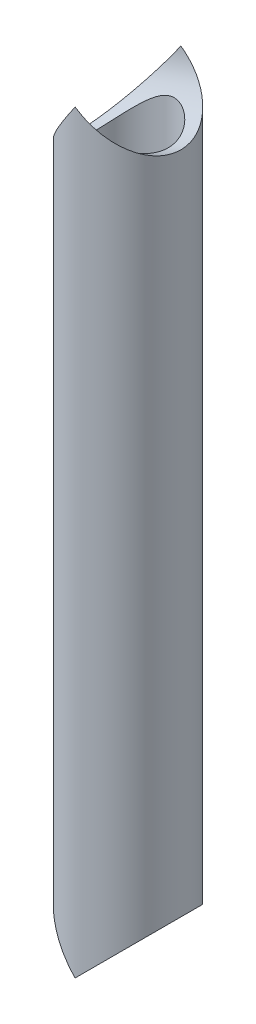
ISO-10303-21;
HEADER;
FILE_DESCRIPTION(('STEP AP214'),'2;1');
FILE_NAME('part.step','',(''),(''),'','','');
FILE_SCHEMA(('AUTOMOTIVE_DESIGN { 1 0 10303 214 1 1 1 1 }'));
ENDSEC;
DATA;
#1=APPLICATION_CONTEXT('core data for automotive mechanical design processes');
#2=APPLICATION_PROTOCOL_DEFINITION('international standard','automotive_design',2000,#1);
#3=PRODUCT_CONTEXT('',#1,'mechanical');
#4=PRODUCT('Part','Part','',(#3));
#5=PRODUCT_RELATED_PRODUCT_CATEGORY('part','',(#4));
#6=PRODUCT_DEFINITION_FORMATION('','',#4);
#7=PRODUCT_DEFINITION_CONTEXT('part definition',#1,'design');
#8=PRODUCT_DEFINITION('design','',#6,#7);
#9=PRODUCT_DEFINITION_SHAPE('','',#8);
#10=(LENGTH_UNIT() NAMED_UNIT(*) SI_UNIT(.MILLI.,.METRE.));
#11=(NAMED_UNIT(*) PLANE_ANGLE_UNIT() SI_UNIT($,.RADIAN.));
#12=(NAMED_UNIT(*) SI_UNIT($,.STERADIAN.) SOLID_ANGLE_UNIT());
#13=UNCERTAINTY_MEASURE_WITH_UNIT(LENGTH_MEASURE(1.E-05),#10,'distance_accuracy_value','');
#14=(GEOMETRIC_REPRESENTATION_CONTEXT(3) GLOBAL_UNCERTAINTY_ASSIGNED_CONTEXT((#13)) GLOBAL_UNIT_ASSIGNED_CONTEXT((#10,
#11,#12)) REPRESENTATION_CONTEXT('',''));
#15=CARTESIAN_POINT('',(0.,0.,0.));
#16=DIRECTION('',(0.,0.,1.));
#17=DIRECTION('',(1.,0.,0.));
#18=AXIS2_PLACEMENT_3D('',#15,#16,#17);
#19=CARTESIAN_POINT('',(2299.99999999996,181.249999999997,275.000000000001));
#20=DIRECTION('',(0.,-1.,0.));
#21=DIRECTION('',(0.,0.,1.));
#22=AXIS2_PLACEMENT_3D('',#19,#20,#21);
#23=CYLINDRICAL_SURFACE('',#22,12.6999999999999);
#24=CARTESIAN_POINT('',(2299.99999999996,181.249999999996,275.000000000001));
#25=DIRECTION('',(-0.818779373097968,0.57410829831078,0.));
#26=DIRECTION('',(-0.574108298310781,-0.818779373097967,0.));
#27=AXIS2_PLACEMENT_3D('',#24,#25,#26);
#28=ELLIPSE('',#27,22.1212618548932,12.6999999999999);
#29=CARTESIAN_POINT('',(2299.99999999996,181.249999999997,287.700000000001));
#30=VERTEX_POINT('',#29);
#31=CARTESIAN_POINT('',(2299.99999999996,181.249999999997,262.300000000001));
#32=VERTEX_POINT('',#31);
#33=EDGE_CURVE('E59',#30,#32,#28,.F.);
#34=ORIENTED_EDGE('',*,*,#33,.T.);
#35=CARTESIAN_POINT('',(2299.99999999996,181.249999999996,275.000000000001));
#36=DIRECTION('',(0.574108298310781,0.818779373097967,0.));
#37=DIRECTION('',(0.818779373097968,-0.57410829831078,0.));
#38=AXIS2_PLACEMENT_3D('',#35,#36,#37);
#39=ELLIPSE('',#38,15.5108939199918,12.6999999999999);
#40=EDGE_CURVE('E68',#32,#30,#39,.F.);
#41=ORIENTED_EDGE('',*,*,#40,.T.);
#42=EDGE_LOOP('',(#34,#41));
#43=FACE_BOUND('',#42,.T.);
#44=CARTESIAN_POINT('',(2299.99999999996,-1.51267887105178E-12,275.000000000001));
#45=DIRECTION('',(-0.70710678118655,0.707106781186546,0.));
#46=DIRECTION('',(-0.707106781186546,-0.707106781186549,0.));
#47=AXIS2_PLACEMENT_3D('',#44,#45,#46);
#48=ELLIPSE('',#47,17.9605122421383,12.6999999999999);
#49=CARTESIAN_POINT('',(2299.99999999996,-1.5404344466674E-12,287.700000000001));
#50=VERTEX_POINT('',#49);
#51=CARTESIAN_POINT('',(2299.99999999996,-4.16333634234434E-12,262.300000000001));
#52=VERTEX_POINT('',#51);
#53=EDGE_CURVE('E85',#50,#52,#48,.T.);
#54=ORIENTED_EDGE('',*,*,#53,.T.);
#55=CARTESIAN_POINT('',(2299.99999999996,-1.51267887105178E-12,275.000000000001));
#56=DIRECTION('',(0.707106781186546,0.707106781186549,0.));
#57=DIRECTION('',(0.70710678118655,-0.707106781186546,0.));
#58=AXIS2_PLACEMENT_3D('',#55,#56,#57);
#59=ELLIPSE('',#58,17.9605122421382,12.6999999999999);
#60=EDGE_CURVE('E77',#52,#50,#59,.T.);
#61=ORIENTED_EDGE('',*,*,#60,.T.);
#62=EDGE_LOOP('',(#54,#61));
#63=FACE_BOUND('',#62,.T.);
#64=ADVANCED_FACE('F45',(#43,#63),#23,.T.);
#65=CARTESIAN_POINT('',(1799.99999999996,-4.20496970576778E-12,275.000000000001));
#66=DIRECTION('',(0.940136065162483,0.3407993236214,0.));
#67=DIRECTION('',(-0.3407993236214,0.940136065162483,0.));
#68=AXIS2_PLACEMENT_3D('',#65,#66,#67);
#69=CYLINDRICAL_SURFACE('',#68,12.7);
#70=CARTESIAN_POINT('',(2299.99999999996,172.467908247635,284.650000000001));
#71=CARTESIAN_POINT('',(2299.73053482446,172.370218189027,284.649997759306));
#72=CARTESIAN_POINT('',(2299.46554248098,172.260056766113,284.638694372456));
#73=CARTESIAN_POINT('',(2298.94662265408,172.019153605129,284.595878168783));
#74=CARTESIAN_POINT('',(2298.69270935676,171.888386416019,284.564340209438));
#75=CARTESIAN_POINT('',(2298.1952072461,171.610087485636,284.483098979186));
#76=CARTESIAN_POINT('',(2297.95169548143,171.46245317265,284.433279994711));
#77=CARTESIAN_POINT('',(2297.4764958178,171.15532292964,284.317415065042));
#78=CARTESIAN_POINT('',(2297.24480572008,170.99582921905,284.251372150784));
#79=CARTESIAN_POINT('',(2296.70031175359,170.60176101783,284.07450685215));
#80=CARTESIAN_POINT('',(2296.39287128243,170.36304733443,283.956398954751));
#81=CARTESIAN_POINT('',(2295.79746676399,169.876438195739,283.692940414183));
#82=CARTESIAN_POINT('',(2295.50951387501,169.628537603784,283.547574340008));
#83=CARTESIAN_POINT('',(2294.95184407707,169.129663568345,283.230515777692));
#84=CARTESIAN_POINT('',(2294.68211252106,168.878692789196,283.058844806216));
#85=CARTESIAN_POINT('',(2294.16001321391,168.378499187879,282.688911920102));
#86=CARTESIAN_POINT('',(2293.9076385082,168.129275701977,282.490660750671));
#87=CARTESIAN_POINT('',(2293.46834534704,167.685553799704,282.108252687632));
#88=CARTESIAN_POINT('',(2293.27830943162,167.489924907236,281.928981075182));
#89=CARTESIAN_POINT('',(2292.91021399962,167.105291024418,281.551861442901));
#90=CARTESIAN_POINT('',(2292.73215545709,166.916286573392,281.354011915367));
#91=CARTESIAN_POINT('',(2292.38954262194,166.548141986001,280.939324997215));
#92=CARTESIAN_POINT('',(2292.22496102757,166.368982161477,280.722527931348));
#93=CARTESIAN_POINT('',(2291.91073877806,166.023518665575,280.269013329519));
#94=CARTESIAN_POINT('',(2291.76109145339,165.857209262865,280.032304773692));
#95=CARTESIAN_POINT('',(2291.42811875588,165.484212809176,279.449133380189));
#96=CARTESIAN_POINT('',(2291.25201934174,165.28449610461,279.093800231935));
#97=CARTESIAN_POINT('',(2291.01788618172,165.017004988662,278.533432042647));
#98=CARTESIAN_POINT('',(2290.94485426117,164.93320005845,278.342115872068));
#99=CARTESIAN_POINT('',(2290.80987402723,164.777818732797,277.950741999339));
#100=CARTESIAN_POINT('',(2290.74792389831,164.706240334358,277.750685735781));
#101=CARTESIAN_POINT('',(2290.64532866594,164.587410751901,277.375727045156));
#102=CARTESIAN_POINT('',(2290.60285878446,164.53809782102,277.201974600978));
#103=CARTESIAN_POINT('',(2290.52724317586,164.450159626415,276.849808707908));
#104=CARTESIAN_POINT('',(2290.49409554138,164.411532176434,276.671396220652));
#105=CARTESIAN_POINT('',(2290.43772976295,164.345777021796,276.311004460584));
#106=CARTESIAN_POINT('',(2290.41450644775,164.318643328177,276.129027097142));
#107=CARTESIAN_POINT('',(2290.37842269942,164.276458788866,275.762646568441));
#108=CARTESIAN_POINT('',(2290.365562346,164.261408036111,275.578243384535));
#109=CARTESIAN_POINT('',(2290.35045422322,164.243724881254,275.207875761226));
#110=CARTESIAN_POINT('',(2290.34823683894,164.241128034375,275.021908368404));
#111=CARTESIAN_POINT('',(2290.3545451394,164.248513004529,274.650407901026));
#112=CARTESIAN_POINT('',(2290.36307085271,164.258494855011,274.464874827626));
#113=CARTESIAN_POINT('',(2290.39068647275,164.290798807495,274.095631182327));
#114=CARTESIAN_POINT('',(2290.40977958537,164.313124654349,273.911921180728));
#115=CARTESIAN_POINT('',(2290.45814082542,164.36959754008,273.547698809239));
#116=CARTESIAN_POINT('',(2290.48740903575,164.403744675258,273.367186465411));
#117=CARTESIAN_POINT('',(2290.55434681284,164.481697765372,273.01687371838));
#118=CARTESIAN_POINT('',(2290.59167801869,164.525114076771,272.846921196638));
#119=CARTESIAN_POINT('',(2290.67470231858,164.62145879688,272.51179726154));
#120=CARTESIAN_POINT('',(2290.7203979906,164.674390138094,272.346627340442));
#121=CARTESIAN_POINT('',(2290.8690598963,164.846137884352,271.859354085998));
#122=CARTESIAN_POINT('',(2290.98363651566,164.977949601629,271.545306792955));
#123=CARTESIAN_POINT('',(2291.31041125978,165.35107940232,270.772028486017));
#124=CARTESIAN_POINT('',(2291.54129786457,165.612324908465,270.33030385345));
#125=CARTESIAN_POINT('',(2291.92329019123,166.037194799253,269.713398596103));
#126=CARTESIAN_POINT('',(2292.05684633344,166.184623291186,269.515051232876));
#127=CARTESIAN_POINT('',(2292.33466133954,166.488321702911,269.133078115759));
#128=CARTESIAN_POINT('',(2292.47891986943,166.644591346763,268.94945190284));
#129=CARTESIAN_POINT('',(2292.84455761016,167.036171481727,268.516565852519));
#130=CARTESIAN_POINT('',(2293.0712854897,167.275238390509,268.275225365091));
#131=CARTESIAN_POINT('',(2293.54309049028,167.76229425933,267.820995665739));
#132=CARTESIAN_POINT('',(2293.78817765643,168.010288064522,267.608122209324));
#133=CARTESIAN_POINT('',(2294.29602912652,168.510492327589,267.209523819256));
#134=CARTESIAN_POINT('',(2294.55880902725,168.762706354603,267.023823309438));
#135=CARTESIAN_POINT('',(2295.10199813402,169.266241985688,266.679210978262));
#136=CARTESIAN_POINT('',(2295.3823999999,169.517563915863,266.520288103288));
#137=CARTESIAN_POINT('',(2295.88312564491,169.946335024737,266.26905215604));
#138=CARTESIAN_POINT('',(2296.09901438737,170.125262695582,266.170385637131));
#139=CARTESIAN_POINT('',(2296.54158878963,170.477335026015,265.987829743365));
#140=CARTESIAN_POINT('',(2296.76827515228,170.650479307888,265.903941332144));
#141=CARTESIAN_POINT('',(2297.23271049986,170.987508301407,265.752072536941));
#142=CARTESIAN_POINT('',(2297.47043127628,171.151414482954,265.684054007376));
#143=CARTESIAN_POINT('',(2297.95819292835,171.466641412139,265.565145386283));
#144=CARTESIAN_POINT('',(2298.20822810032,171.617967900637,265.514247448949));
#145=CARTESIAN_POINT('',(2298.63986546246,171.858377782197,265.444685248814));
#146=CARTESIAN_POINT('',(2298.8181143464,171.952015177421,265.420917602166));
#147=CARTESIAN_POINT('',(2299.18032461408,172.129673692137,265.383151750566));
#148=CARTESIAN_POINT('',(2299.36428407882,172.213697998511,265.369150300084));
#149=CARTESIAN_POINT('',(2299.73718388123,172.370416599529,265.351777100898));
#150=CARTESIAN_POINT('',(2299.92611672571,172.443126912917,265.348390191191));
#151=CARTESIAN_POINT('',(2300.30827256465,172.575886347668,265.35303313427));
#152=CARTESIAN_POINT('',(2300.50149544033,172.635935819132,265.361062671318));
#153=CARTESIAN_POINT('',(2300.89241144788,172.742704146845,265.389339259386));
#154=CARTESIAN_POINT('',(2301.09012801355,172.789312119353,265.409683871265));
#155=CARTESIAN_POINT('',(2301.48672693155,172.868035297717,265.463115115684));
#156=CARTESIAN_POINT('',(2301.68560928388,172.90015050359,265.496201748208));
#157=CARTESIAN_POINT('',(2302.08273056967,172.950131055175,265.57525856253));
#158=CARTESIAN_POINT('',(2302.2809689797,172.967986791114,265.621237404525));
#159=CARTESIAN_POINT('',(2302.6748151356,172.990337576116,265.725875317573));
#160=CARTESIAN_POINT('',(2302.87042282271,172.994832327219,265.784534671379));
#161=CARTESIAN_POINT('',(2303.23962355314,172.992041803571,265.908153032472));
#162=CARTESIAN_POINT('',(2303.41358786701,172.985801033579,265.972037872669));
#163=CARTESIAN_POINT('',(2303.75713296598,172.964784037057,266.109514572788));
#164=CARTESIAN_POINT('',(2303.92671213693,172.950004712946,266.183109947975));
#165=CARTESIAN_POINT('',(2304.42784557373,172.894881000918,266.41788967582));
#166=CARTESIAN_POINT('',(2304.75180715099,172.843750616685,266.593071461264));
#167=CARTESIAN_POINT('',(2305.29455959348,172.738691671621,266.927569865762));
#168=CARTESIAN_POINT('',(2305.51894260648,172.688877981324,267.079345713224));
#169=CARTESIAN_POINT('',(2305.9533140424,172.582717481231,267.400431113796));
#170=CARTESIAN_POINT('',(2306.1632974197,172.526368399866,267.569746761184));
#171=CARTESIAN_POINT('',(2306.56805994898,172.410216054049,267.924994202727));
#172=CARTESIAN_POINT('',(2306.76282201821,172.350409036068,268.110944177614));
#173=CARTESIAN_POINT('',(2307.1360210879,172.230065475426,268.498306765165));
#174=CARTESIAN_POINT('',(2307.31445975823,172.169529008104,268.69971779229));
#175=CARTESIAN_POINT('',(2307.65542013288,172.04955086513,269.118627955483));
#176=CARTESIAN_POINT('',(2307.81780830623,171.990121251027,269.336239300013));
#177=CARTESIAN_POINT('',(2308.12407224244,171.874876942633,269.785045492319));
#178=CARTESIAN_POINT('',(2308.26794760491,171.819062326536,270.01624063372));
#179=CARTESIAN_POINT('',(2308.53601675936,171.712858274085,270.490773445517));
#180=CARTESIAN_POINT('',(2308.6602231113,171.662465382248,270.734103235526));
#181=CARTESIAN_POINT('',(2308.88797143843,171.568601012514,271.231541280481));
#182=CARTESIAN_POINT('',(2308.99151404021,171.525129324751,271.485649208313));
#183=CARTESIAN_POINT('',(2309.17596447705,171.446803545576,272.000309645774));
#184=CARTESIAN_POINT('',(2309.25708937214,171.411867223489,272.260771700066));
#185=CARTESIAN_POINT('',(2309.39717759498,171.351074650212,272.788640060479));
#186=CARTESIAN_POINT('',(2309.45614087054,171.325218420398,273.056046382947));
#187=CARTESIAN_POINT('',(2309.55118338372,171.283354255913,273.595577187641));
#188=CARTESIAN_POINT('',(2309.58726964824,171.267343297212,273.867700194679));
#189=CARTESIAN_POINT('',(2309.63612579955,171.245633474846,274.414432680925));
#190=CARTESIAN_POINT('',(2309.64889736631,171.239933868183,274.689041979547));
#191=CARTESIAN_POINT('',(2309.65088296246,171.239048242282,275.216286119155));
#192=CARTESIAN_POINT('',(2309.64190620818,171.243054778942,275.468914908257));
#193=CARTESIAN_POINT('',(2309.60420102593,171.25982506276,275.972388783244));
#194=CARTESIAN_POINT('',(2309.57547380336,171.272588275492,276.223233977039));
#195=CARTESIAN_POINT('',(2309.49858332921,171.306549698006,276.721310895051));
#196=CARTESIAN_POINT('',(2309.4504222859,171.327746949419,276.968543026516));
#197=CARTESIAN_POINT('',(2309.33516071545,171.378048039254,277.457727559054));
#198=CARTESIAN_POINT('',(2309.26805983618,171.407152024675,277.699679861876));
#199=CARTESIAN_POINT('',(2309.11609287312,171.472318525363,278.175090948703));
#200=CARTESIAN_POINT('',(2309.03135271699,171.508331580853,278.408596860839));
#201=CARTESIAN_POINT('',(2308.84456786848,171.586563518522,278.867491595145));
#202=CARTESIAN_POINT('',(2308.7425233619,171.628782334068,279.092880504438));
#203=CARTESIAN_POINT('',(2308.52188363618,171.718402201551,279.534416350076));
#204=CARTESIAN_POINT('',(2308.40328306147,171.765804929307,279.750560266165));
#205=CARTESIAN_POINT('',(2308.15035595184,171.864588914034,280.172495483765));
#206=CARTESIAN_POINT('',(2308.01602824801,171.915970466636,280.378286014133));
#207=CARTESIAN_POINT('',(2307.72198117068,172.025241981729,280.793347092175));
#208=CARTESIAN_POINT('',(2307.56112013454,172.083332540011,281.001756696156));
#209=CARTESIAN_POINT('',(2307.22308401382,172.200635477715,281.404584734734));
#210=CARTESIAN_POINT('',(2307.04590728267,172.259847969885,281.599001753662));
#211=CARTESIAN_POINT('',(2306.67602514394,172.377219563241,281.972975644404));
#212=CARTESIAN_POINT('',(2306.48331318166,172.435378206973,282.152526178222));
#213=CARTESIAN_POINT('',(2306.0832488222,172.548061362866,282.495733766435));
#214=CARTESIAN_POINT('',(2305.87589869451,172.602586435834,282.65939327525));
#215=CARTESIAN_POINT('',(2305.47957070307,172.697326296517,282.946531596886));
#216=CARTESIAN_POINT('',(2305.29250807008,172.738460546252,283.072354015057));
#217=CARTESIAN_POINT('',(2304.9090248277,172.8138345128,283.311135434399));
#218=CARTESIAN_POINT('',(2304.71260588048,172.848075448621,283.424096708387));
#219=CARTESIAN_POINT('',(2304.31147985033,172.907271483493,283.636263101621));
#220=CARTESIAN_POINT('',(2304.10678568848,172.932240482794,283.735488671849));
#221=CARTESIAN_POINT('',(2303.68996362096,172.970437408307,283.919558771418));
#222=CARTESIAN_POINT('',(2303.47783756582,172.98366823601,284.004406850452));
#223=CARTESIAN_POINT('',(2303.08608674462,172.994805726513,284.145153786568));
#224=CARTESIAN_POINT('',(2302.90741147709,172.995024265337,284.203516869633));
#225=CARTESIAN_POINT('',(2302.54726008047,172.984624801551,284.309628681743));
#226=CARTESIAN_POINT('',(2302.36578458159,172.974009203211,284.357379762901));
#227=CARTESIAN_POINT('',(2302.00158871129,172.941034164224,284.441983273501));
#228=CARTESIAN_POINT('',(2301.81887013265,172.918689094121,284.478848953192));
#229=CARTESIAN_POINT('',(2301.45352041814,172.861792199778,284.541704668761));
#230=CARTESIAN_POINT('',(2301.2708892728,172.827244186212,284.567698094244));
#231=CARTESIAN_POINT('',(2300.90500623726,172.745502459949,284.609253783223));
#232=CARTESIAN_POINT('',(2300.72177211717,172.698165416768,284.624690345882));
#233=CARTESIAN_POINT('',(2300.35837474745,172.591667069626,284.645060112606));
#234=CARTESIAN_POINT('',(2300.17820921882,172.532514996919,284.650001481872));
#235=CARTESIAN_POINT('',(2299.99999999996,172.467908247635,284.650000000001));
#236=B_SPLINE_CURVE_WITH_KNOTS('',3,(#70,#71,#72,#73,#74,#75,#76,#77,#78,#79,#80,#81,#82,#83,
#84,#85,#86,#87,#88,#89,#90,#91,#92,#93,#94,#95,#96,#97,#98,#99,#100,#101,#102,#103,#104,#105,
#106,#107,#108,#109,#110,#111,#112,#113,#114,#115,#116,#117,#118,#119,#120,#121,#122,#123,#124,
#125,#126,#127,#128,#129,#130,#131,#132,#133,#134,#135,#136,#137,#138,#139,#140,#141,#142,#143,
#144,#145,#146,#147,#148,#149,#150,#151,#152,#153,#154,#155,#156,#157,#158,#159,#160,#161,#162,
#163,#164,#165,#166,#167,#168,#169,#170,#171,#172,#173,#174,#175,#176,#177,#178,#179,#180,#181,
#182,#183,#184,#185,#186,#187,#188,#189,#190,#191,#192,#193,#194,#195,#196,#197,#198,#199,#200,
#201,#202,#203,#204,#205,#206,#207,#208,#209,#210,#211,#212,#213,#214,#215,#216,#217,#218,#219,
#220,#221,#222,#223,#224,#225,#226,#227,#228,#229,#230,#231,#232,#233,#234,#235),.UNSPECIFIED.,
.T.,.F.,(4,2,2,2,2,2,2,2,2,2,2,2,2,2,2,2,2,2,2,2,2,2,2,2,2,2,2,2,2,2,2,2,2,2,2,2,2,2,2,2,2,2,2,
2,2,2,2,2,2,2,2,2,2,2,2,2,2,2,2,2,2,2,2,2,2,2,2,2,2,2,2,2,2,2,2,2,2,2,2,2,2,2,4),(0.,
0.85956480092131,1.72019973033594,2.58637893968347,3.45239645340109,4.67086270441151,
5.89002082984862,7.10818698994395,8.32586217554469,9.30426642642538,10.2827501491396,
11.2591999090223,12.2352116246843,13.5620039284862,14.2251760081481,14.8882393400177,
15.4443119321435,16.0002706671357,16.555939355651,17.111612318181,17.6688707561132,
18.2261306758476,18.7835597467798,19.340993358886,19.8784665437069,20.4161056610598,
21.4908238050822,23.1690661221741,24.0113241392334,24.8535558831466,26.0770645424319,
27.3012475929254,28.5265243035212,29.7512939829841,30.6425157624065,31.5337956343069,
32.4229105913923,33.3116175392895,33.9193878144768,34.5269560173332,35.1336560195331,
35.7403392429389,36.3518927260381,36.9634462083925,37.5754114831919,38.1873904051506,
38.7431350958184,39.2990815239091,40.4109386475581,41.2363370250298,42.0620231588261,
42.8886230295086,43.7151382448649,44.5480349241406,45.3809496137405,46.2133302688706,
47.0456856795554,47.8696743510834,48.6936649623993,49.5174023536227,50.3410803869932,
51.0986209696201,51.8561153230385,52.6135236262341,53.370946011955,54.1231359800807,
54.8753178723953,55.6277436475559,56.3802253823081,57.1881546687048,57.9961655810247,
58.8045192159797,59.6127477989008,60.2996371955591,60.986405016436,61.6721390557604,
62.3577035451617,62.9210191383646,63.4842097498882,64.0467119646701,64.6090386790996,
65.1779496080388,65.74641776516),.UNSPECIFIED.);
#237=CARTESIAN_POINT('',(2299.99999999996,172.467908247635,284.650000000001));
#238=VERTEX_POINT('',#237);
#239=EDGE_CURVE('E11',#238,#238,#236,.T.);
#240=ORIENTED_EDGE('',*,*,#239,.T.);
#241=EDGE_LOOP('',(#240));
#242=FACE_BOUND('',#241,.T.);
#243=ORIENTED_EDGE('',*,*,#33,.F.);
#244=ORIENTED_EDGE('',*,*,#40,.F.);
#245=EDGE_LOOP('',(#243,#244));
#246=FACE_BOUND('',#245,.T.);
#247=ADVANCED_FACE('F103',(#242,#246),#69,.F.);
#248=CARTESIAN_POINT('',(1799.99999999996,-4.12170297892089E-12,275.000000000001));
#249=DIRECTION('',(1.,0.,0.));
#250=DIRECTION('',(0.,1.,0.));
#251=AXIS2_PLACEMENT_3D('',#248,#249,#250);
#252=CYLINDRICAL_SURFACE('',#251,12.7);
#253=CARTESIAN_POINT('',(2299.99999999996,8.25636118395842,284.650000000001));
#254=CARTESIAN_POINT('',(2300.2238809479,8.25636650160305,284.649997471153));
#255=CARTESIAN_POINT('',(2300.44779598858,8.26552111122355,284.642185976445));
#256=CARTESIAN_POINT('',(2300.89312189135,8.30155650462335,284.611175788682));
#257=CARTESIAN_POINT('',(2301.11453214946,8.32844147486633,284.587973461561));
#258=CARTESIAN_POINT('',(2301.55330914591,8.39840451080104,284.526749222472));
#259=CARTESIAN_POINT('',(2301.7706625495,8.44152854567089,284.488685229058));
#260=CARTESIAN_POINT('',(2302.19920636251,8.54169432810287,284.398615818278));
#261=CARTESIAN_POINT('',(2302.41039430787,8.59874155714344,284.346604909298));
#262=CARTESIAN_POINT('',(2302.86846446711,8.73719433783208,284.217490354832));
#263=CARTESIAN_POINT('',(2303.11372202509,8.82119710367517,284.13742362549));
#264=CARTESIAN_POINT('',(2303.59306589356,9.00156935271057,283.959785989283));
#265=CARTESIAN_POINT('',(2303.82714896829,9.09794238847478,283.862210050796));
#266=CARTESIAN_POINT('',(2304.28407961302,9.29939516527677,283.650584442118));
#267=CARTESIAN_POINT('',(2304.50691688092,9.40448266467971,283.536520023855));
#268=CARTESIAN_POINT('',(2304.94106326866,9.62008904980574,283.292789857837));
#269=CARTESIAN_POINT('',(2305.15237338134,9.73060746620049,283.163125456802));
#270=CARTESIAN_POINT('',(2305.56830672249,9.95702736946201,282.885458668398));
#271=CARTESIAN_POINT('',(2305.77265217323,10.0729943631192,282.737094058676));
#272=CARTESIAN_POINT('',(2306.16900131329,10.3052560033119,282.424927970279));
#273=CARTESIAN_POINT('',(2306.36100460787,10.4215506602032,282.261125998283));
#274=CARTESIAN_POINT('',(2306.73207460018,10.6520993133467,281.91848178545));
#275=CARTESIAN_POINT('',(2306.91115144745,10.7663548564068,281.739651588531));
#276=CARTESIAN_POINT('',(2307.25584339355,10.9907989746195,281.367074058027));
#277=CARTESIAN_POINT('',(2307.42145912612,11.1009877410927,281.173327427507));
#278=CARTESIAN_POINT('',(2307.73163925038,11.3107584124202,280.779652355224));
#279=CARTESIAN_POINT('',(2307.87679554221,11.4105914116386,280.58032497267));
#280=CARTESIAN_POINT('',(2308.15284148754,11.6028668966314,280.168662733001));
#281=CARTESIAN_POINT('',(2308.2837332496,11.6953104741548,279.956329805607));
#282=CARTESIAN_POINT('',(2308.53006644363,11.8710609081059,279.519225052687));
#283=CARTESIAN_POINT('',(2308.64550703063,11.9543672648045,279.294452547831));
#284=CARTESIAN_POINT('',(2308.85958379957,12.1100921094653,278.833388187829));
#285=CARTESIAN_POINT('',(2308.95822011415,12.1825106833701,278.597096423631));
#286=CARTESIAN_POINT('',(2309.13812450243,12.3154012305782,278.112025500927));
#287=CARTESIAN_POINT('',(2309.21922217784,12.3757555998474,277.863150502245));
#288=CARTESIAN_POINT('',(2309.36148671678,12.4820951324542,277.356740010992));
#289=CARTESIAN_POINT('',(2309.42265328476,12.5280800827093,277.099204390056));
#290=CARTESIAN_POINT('',(2309.52380445426,12.6043344622585,276.577987368538));
#291=CARTESIAN_POINT('',(2309.56381126087,12.6346203654824,276.314312714946));
#292=CARTESIAN_POINT('',(2309.62187152846,12.6786256550751,275.783203892268));
#293=CARTESIAN_POINT('',(2309.63992898451,12.6923480562058,275.515770416301));
#294=CARTESIAN_POINT('',(2309.65264386903,12.7020088617574,275.021175400174));
#295=CARTESIAN_POINT('',(2309.65046784581,12.7003538689969,274.79413372961));
#296=CARTESIAN_POINT('',(2309.63015326612,12.6849243541179,274.341198970451));
#297=CARTESIAN_POINT('',(2309.61201665637,12.6711513100522,274.115305745158));
#298=CARTESIAN_POINT('',(2309.56007469284,12.6317948960897,273.666381089012));
#299=CARTESIAN_POINT('',(2309.52626931532,12.606211508297,273.443349662496));
#300=CARTESIAN_POINT('',(2309.44350913262,12.5437883797093,273.00172338559));
#301=CARTESIAN_POINT('',(2309.39455392064,12.5069483366488,272.783128654502));
#302=CARTESIAN_POINT('',(2309.28397177702,12.4241029996189,272.358607568935));
#303=CARTESIAN_POINT('',(2309.2227951782,12.378424859462,272.152499248937));
#304=CARTESIAN_POINT('',(2309.08760165531,12.2780272819771,271.746732946512));
#305=CARTESIAN_POINT('',(2309.01358031607,12.2233047360879,271.547077210142));
#306=CARTESIAN_POINT('',(2308.85351814761,12.1057562302849,271.155197630732));
#307=CARTESIAN_POINT('',(2308.76748087384,12.0429326678354,270.962971610684));
#308=CARTESIAN_POINT('',(2308.58412444449,11.9101090414245,270.586478532353));
#309=CARTESIAN_POINT('',(2308.48680124829,11.8401064082424,270.402214357194));
#310=CARTESIAN_POINT('',(2308.26814620199,11.6843101232695,270.018512269001));
#311=CARTESIAN_POINT('',(2308.14534017242,11.5976504909959,269.820265801703));
#312=CARTESIAN_POINT('',(2307.88721125462,11.4178378866164,269.435093917832));
#313=CARTESIAN_POINT('',(2307.75188304738,11.3246821593599,269.248173368441));
#314=CARTESIAN_POINT('',(2307.46946263948,11.1332644182827,268.885882271667));
#315=CARTESIAN_POINT('',(2307.32235896641,11.0349974582244,268.710523299163));
#316=CARTESIAN_POINT('',(2307.01725064134,10.8349454704604,268.371829999691));
#317=CARTESIAN_POINT('',(2306.85924881123,10.7331613568393,268.208492582431));
#318=CARTESIAN_POINT('',(2306.49945938943,10.5065279577586,267.861788650838));
#319=CARTESIAN_POINT('',(2306.295323438,10.3812168353868,267.681152848841));
#320=CARTESIAN_POINT('',(2305.87255427908,10.1304200601689,267.337767354395));
#321=CARTESIAN_POINT('',(2305.65391758764,10.0049343725236,267.175021985438));
#322=CARTESIAN_POINT('',(2305.20247270437,9.75692814531907,266.867885866329));
#323=CARTESIAN_POINT('',(2304.96966483976,9.63440753738503,266.7234946926));
#324=CARTESIAN_POINT('',(2304.49016381972,9.39605116186092,266.453852671959));
#325=CARTESIAN_POINT('',(2304.24347572457,9.2802129888704,266.328594910715));
#326=CARTESIAN_POINT('',(2303.62370514064,9.01055914500794,266.047202974483));
#327=CARTESIAN_POINT('',(2303.24290764359,8.86255803907158,265.901855106179));
#328=CARTESIAN_POINT('',(2302.65189314292,8.66980372388422,265.719244871426));
#329=CARTESIAN_POINT('',(2302.45173328474,8.61045838748207,265.664302996782));
#330=CARTESIAN_POINT('',(2302.04523823548,8.50365137150217,265.566913154354));
#331=CARTESIAN_POINT('',(2301.83890426745,8.45618735549764,265.524462729875));
#332=CARTESIAN_POINT('',(2301.45431956732,8.3816947351774,265.458550180121));
#333=CARTESIAN_POINT('',(2301.27679652053,8.35262020016663,265.433145556601));
#334=CARTESIAN_POINT('',(2300.91917999003,8.30548031772598,265.39219180822));
#335=CARTESIAN_POINT('',(2300.73908705287,8.28741266406855,265.376640618782));
#336=CARTESIAN_POINT('',(2300.37762651766,8.26302688231353,265.355693440158));
#337=CARTESIAN_POINT('',(2300.19625980511,8.25670127345301,265.35029098527));
#338=CARTESIAN_POINT('',(2299.83348362387,8.25604788289179,265.3497319337));
#339=CARTESIAN_POINT('',(2299.65207415426,8.26172039198434,265.354575585349));
#340=CARTESIAN_POINT('',(2299.29091129821,8.28479826519297,265.374391221174));
#341=CARTESIAN_POINT('',(2299.11115545643,8.30218175487692,265.389344322532));
#342=CARTESIAN_POINT('',(2298.7541674946,8.34794875853338,265.429071960344));
#343=CARTESIAN_POINT('',(2298.57693537882,8.37633229107087,265.453846513374));
#344=CARTESIAN_POINT('',(2298.22573020293,8.44308943787645,265.512839201216));
#345=CARTESIAN_POINT('',(2298.05176178097,8.48147626238905,265.547069827238));
#346=CARTESIAN_POINT('',(2297.70799504505,8.56697417067242,265.624485259924));
#347=CARTESIAN_POINT('',(2297.53819791417,8.61408769794838,265.667672574897));
#348=CARTESIAN_POINT('',(2297.12447740184,8.73962656542303,265.784830008542));
#349=CARTESIAN_POINT('',(2296.8832436018,8.82235793134378,265.863725585581));
#350=CARTESIAN_POINT('',(2296.41155733376,8.99981069173787,266.038476052039));
#351=CARTESIAN_POINT('',(2296.18111006207,9.09453778524623,266.134339011136));
#352=CARTESIAN_POINT('',(2295.73088996493,9.29257029218158,266.342126624723));
#353=CARTESIAN_POINT('',(2295.51113673912,9.39589058091654,266.454079386058));
#354=CARTESIAN_POINT('',(2295.0828227744,9.60788792873918,266.693134423815));
#355=CARTESIAN_POINT('',(2294.8742606252,9.71656430953536,266.820234784832));
#356=CARTESIAN_POINT('',(2294.46054389006,9.94091141867814,267.094253325404));
#357=CARTESIAN_POINT('',(2294.25582857462,10.0566904184988,267.241745548556));
#358=CARTESIAN_POINT('',(2293.85869660894,10.2886901779402,267.552154083836));
#359=CARTESIAN_POINT('',(2293.66628064026,10.4049109616643,267.715071249479));
#360=CARTESIAN_POINT('',(2293.29436069032,10.6354044939347,268.055904695521));
#361=CARTESIAN_POINT('',(2293.11484480299,10.749678962507,268.233806807409));
#362=CARTESIAN_POINT('',(2292.76914131129,10.9743134887968,268.604576575237));
#363=CARTESIAN_POINT('',(2292.6029580735,11.0846722575293,268.797449093801));
#364=CARTESIAN_POINT('',(2292.29102235073,11.2952697991767,269.190129443297));
#365=CARTESIAN_POINT('',(2292.14473046355,11.3957344296568,269.389386815747));
#366=CARTESIAN_POINT('',(2291.86644430119,11.5893157638869,269.801012469891));
#367=CARTESIAN_POINT('',(2291.73444788075,11.6824335695763,270.013378776847));
#368=CARTESIAN_POINT('',(2291.48602134663,11.8595003557766,270.45051367823));
#369=CARTESIAN_POINT('',(2291.36958199476,11.9434547722691,270.675274799258));
#370=CARTESIAN_POINT('',(2291.15353976976,12.100489847021,271.136396485112));
#371=CARTESIAN_POINT('',(2291.05393409963,12.1735723114707,271.372755114515));
#372=CARTESIAN_POINT('',(2290.88647319918,12.2972021624835,271.81970562566));
#373=CARTESIAN_POINT('',(2290.81609786775,12.3494849992028,272.028875494399));
#374=CARTESIAN_POINT('',(2290.68938395762,12.4440061327461,272.453625298769));
#375=CARTESIAN_POINT('',(2290.63304295173,12.4862461663767,272.669204118768));
#376=CARTESIAN_POINT('',(2290.53516759604,12.5598372396133,273.105431274593));
#377=CARTESIAN_POINT('',(2290.49362666938,12.5911931157549,273.326077312136));
#378=CARTESIAN_POINT('',(2290.42592945134,12.6423825053804,273.77105145885));
#379=CARTESIAN_POINT('',(2290.39977333548,12.6622158874029,273.995379610002));
#380=CARTESIAN_POINT('',(2290.36320844145,12.6899609443247,274.446695398274));
#381=CARTESIAN_POINT('',(2290.35284434057,12.6978387955096,274.673688756615));
#382=CARTESIAN_POINT('',(2290.3481751738,12.7013865427146,275.12793730875));
#383=CARTESIAN_POINT('',(2290.35387013945,12.6970564147694,275.355192503058));
#384=CARTESIAN_POINT('',(2290.38122639794,12.6762860025406,275.80820535951));
#385=CARTESIAN_POINT('',(2290.40288965421,12.6598442290505,276.033962834053));
#386=CARTESIAN_POINT('',(2290.46183636499,12.6152168058431,276.482242579319));
#387=CARTESIAN_POINT('',(2290.49911961789,12.5870313077139,276.704764891762));
#388=CARTESIAN_POINT('',(2290.58686064145,12.5209383638381,277.135800784473));
#389=CARTESIAN_POINT('',(2290.63670177084,12.4834871381322,277.344510902725));
#390=CARTESIAN_POINT('',(2290.74958136652,12.3990460013952,277.756424753405));
#391=CARTESIAN_POINT('',(2290.81262440323,12.3520527871496,277.959626551293));
#392=CARTESIAN_POINT('',(2290.95115300241,12.2493661659144,278.359407037535));
#393=CARTESIAN_POINT('',(2291.02663547874,12.1936749170194,278.555987354097));
#394=CARTESIAN_POINT('',(2291.18931660253,12.0744597532247,278.941854978068));
#395=CARTESIAN_POINT('',(2291.27651951303,12.0109329890162,279.131139599435));
#396=CARTESIAN_POINT('',(2291.47155112331,11.870001273722,279.521108768999));
#397=CARTESIAN_POINT('',(2291.58058290692,11.7918397886643,279.720917967532));
#398=CARTESIAN_POINT('',(2291.8110636258,11.6283951565767,280.110287204058));
#399=CARTESIAN_POINT('',(2291.93251775613,11.543109032759,280.299842902927));
#400=CARTESIAN_POINT('',(2292.18698850641,11.3667159632159,280.66828905598));
#401=CARTESIAN_POINT('',(2292.32000977782,11.2756066797832,280.847175170437));
#402=CARTESIAN_POINT('',(2292.59683495495,11.0889092508834,281.193938863954));
#403=CARTESIAN_POINT('',(2292.74064020531,10.9933205474422,281.361815065292));
#404=CARTESIAN_POINT('',(2293.06803480299,10.779671749515,281.718636600715));
#405=CARTESIAN_POINT('',(2293.25384888645,10.6609229956605,281.905133270261));
#406=CARTESIAN_POINT('',(2293.63932210958,10.4212724909291,282.261765948333));
#407=CARTESIAN_POINT('',(2293.83898381632,10.3003703439609,282.431898909332));
#408=CARTESIAN_POINT('',(2294.25177181474,10.0589052180191,282.755592608363));
#409=CARTESIAN_POINT('',(2294.46490697409,9.93834251813471,282.90914224806));
#410=CARTESIAN_POINT('',(2294.90425132127,9.70051680113902,283.19909181584));
#411=CARTESIAN_POINT('',(2295.13045792549,9.58325313873452,283.335495116113));
#412=CARTESIAN_POINT('',(2295.55465379377,9.37554010230663,283.567908947777));
#413=CARTESIAN_POINT('',(2295.75054553921,9.28401981570636,283.666794833639));
#414=CARTESIAN_POINT('',(2296.15113330312,9.10763061532469,283.851972087268));
#415=CARTESIAN_POINT('',(2296.35582946437,9.02276180946865,283.938263250696));
#416=CARTESIAN_POINT('',(2296.77349996583,8.86231895471071,284.09736499116));
#417=CARTESIAN_POINT('',(2296.98645924997,8.78672895755584,284.170198810504));
#418=CARTESIAN_POINT('',(2297.42050442695,8.64749185276201,284.301616063244));
#419=CARTESIAN_POINT('',(2297.64158677035,8.58383960131772,284.360205637524));
#420=CARTESIAN_POINT('',(2298.03805424514,8.48463672046878,284.45009561726));
#421=CARTESIAN_POINT('',(2298.21194929518,8.44599802469557,284.484573277887));
#422=CARTESIAN_POINT('',(2298.56317606682,8.37868076612143,284.544094137191));
#423=CARTESIAN_POINT('',(2298.74050581759,8.3499966602538,284.569142587044));
#424=CARTESIAN_POINT('',(2299.09754822041,8.30365189726459,284.609386806696));
#425=CARTESIAN_POINT('',(2299.27725837777,8.28598050830668,284.624592169095));
#426=CARTESIAN_POINT('',(2299.63797180321,8.26233437904365,284.644898598372));
#427=CARTESIAN_POINT('',(2299.81897475669,8.25635688422715,284.650002044772));
#428=CARTESIAN_POINT('',(2299.99999999996,8.25636118395842,284.650000000001));
#429=B_SPLINE_CURVE_WITH_KNOTS('',3,(#253,#254,#255,#256,#257,#258,#259,#260,#261,#262,#263,
#264,#265,#266,#267,#268,#269,#270,#271,#272,#273,#274,#275,#276,#277,#278,#279,#280,#281,#282,
#283,#284,#285,#286,#287,#288,#289,#290,#291,#292,#293,#294,#295,#296,#297,#298,#299,#300,#301,
#302,#303,#304,#305,#306,#307,#308,#309,#310,#311,#312,#313,#314,#315,#316,#317,#318,#319,#320,
#321,#322,#323,#324,#325,#326,#327,#328,#329,#330,#331,#332,#333,#334,#335,#336,#337,#338,#339,
#340,#341,#342,#343,#344,#345,#346,#347,#348,#349,#350,#351,#352,#353,#354,#355,#356,#357,#358,
#359,#360,#361,#362,#363,#364,#365,#366,#367,#368,#369,#370,#371,#372,#373,#374,#375,#376,#377,
#378,#379,#380,#381,#382,#383,#384,#385,#386,#387,#388,#389,#390,#391,#392,#393,#394,#395,#396,
#397,#398,#399,#400,#401,#402,#403,#404,#405,#406,#407,#408,#409,#410,#411,#412,#413,#414,#415,
#416,#417,#418,#419,#420,#421,#422,#423,#424,#425,#426,#427,#428),.UNSPECIFIED.,.T.,.F.,(4,2,2,
2,2,2,2,2,2,2,2,2,2,2,2,2,2,2,2,2,2,2,2,2,2,2,2,2,2,2,2,2,2,2,2,2,2,2,2,2,2,2,2,2,2,2,2,2,2,2,2,
2,2,2,2,2,2,2,2,2,2,2,2,2,2,2,2,2,2,2,2,2,2,2,2,2,2,2,2,2,2,2,2,2,2,2,2,4),(0.,
0.671388216053098,1.34293501597631,2.01639728297794,2.6901251169577,3.50284680113828,
4.31580241225155,5.12948972081659,5.94310683548711,6.77603626888332,7.60899232867235,
8.44128709329721,9.27354265277015,10.0708563004877,10.8680519306422,11.6652911389633,
12.4625240539582,13.2671854568247,14.0718587913485,14.8756860168625,15.6793669138251,
16.3596774651138,17.0399050496451,17.7201336649136,18.4003805473891,19.0590875510849,
19.718021424909,20.376760735458,21.0357366214717,21.7813767458616,22.527335060527,
23.274029193851,24.020530704747,24.9196255407808,25.8189371811312,26.7182280635424,
27.6171931921703,28.9130820785525,29.5601152219657,30.2070210280802,30.751473699066,
31.2958122538045,31.8398038956174,32.3838087220746,32.9268002325266,33.4697926593993,
34.0135058227395,34.5573714583091,35.3569857878314,36.1569814404246,36.958391964611,
37.7597012582517,38.5918172217698,39.4239792560938,40.2553631149331,41.0870181596386,
41.8867475795128,42.6863568202173,43.4854891019689,44.2844884728438,44.9641894144954,
45.6437727227465,46.3230536604054,47.002342347904,47.6835492700318,48.3647575294272,
49.0460495618427,49.7273328004142,50.380104796902,51.0331031543251,51.6859397510585,
52.3390144492581,53.0603263298722,53.7819411080624,54.5038474205456,55.2258438968064,
56.091412762528,56.9571425182029,57.8234481166152,58.6895830702312,59.4023259760534,
60.1150804442815,60.8265921595327,61.5377965865485,62.0816281586102,62.6251564183498,
63.1681541809213,63.711024024284),.UNSPECIFIED.);
#430=CARTESIAN_POINT('',(2299.99999999996,8.25636118395842,284.650000000001));
#431=VERTEX_POINT('',#430);
#432=EDGE_CURVE('E90',#431,#431,#429,.T.);
#433=ORIENTED_EDGE('',*,*,#432,.T.);
#434=EDGE_LOOP('',(#433));
#435=FACE_BOUND('',#434,.T.);
#436=ORIENTED_EDGE('',*,*,#53,.F.);
#437=ORIENTED_EDGE('',*,*,#60,.F.);
#438=EDGE_LOOP('',(#436,#437));
#439=FACE_BOUND('',#438,.T.);
#440=ADVANCED_FACE('F88',(#435,#439),#252,.F.);
#441=CARTESIAN_POINT('',(2299.99999999996,181.249999999997,275.000000000001));
#442=DIRECTION('',(0.,-1.,0.));
#443=DIRECTION('',(0.,0.,1.));
#444=AXIS2_PLACEMENT_3D('',#441,#442,#443);
#445=CYLINDRICAL_SURFACE('',#444,9.64999999999982);
#446=ORIENTED_EDGE('',*,*,#239,.F.);
#447=EDGE_LOOP('',(#446));
#448=FACE_BOUND('',#447,.T.);
#449=ORIENTED_EDGE('',*,*,#432,.F.);
#450=EDGE_LOOP('',(#449));
#451=FACE_BOUND('',#450,.T.);
#452=ADVANCED_FACE('F47',(#448,#451),#445,.F.);
#453=CLOSED_SHELL('',(#64,#247,#440,#452));
#454=MANIFOLD_SOLID_BREP('B2',#453);
#455=ADVANCED_BREP_SHAPE_REPRESENTATION('',(#18,#454),#14);
#456=SHAPE_DEFINITION_REPRESENTATION(#9,#455);
ENDSEC;
END-ISO-10303-21;
